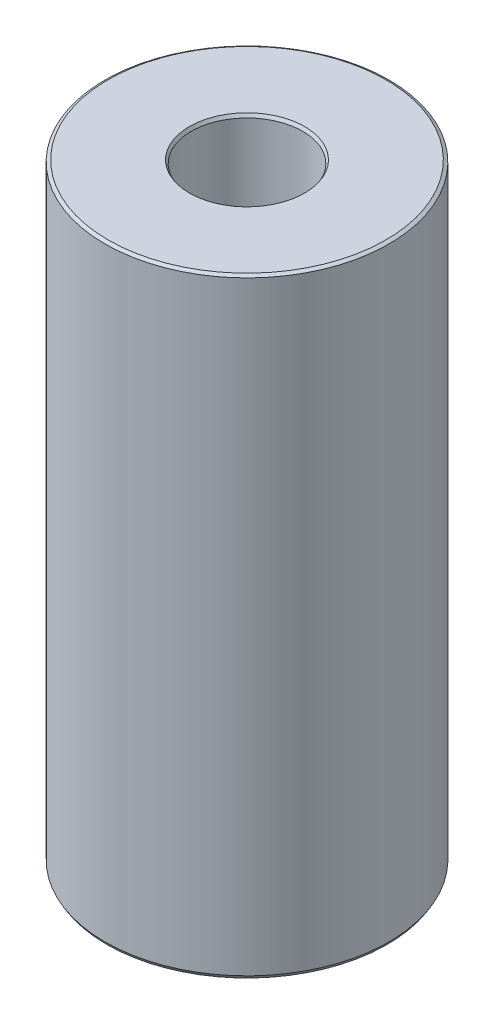
ISO-10303-21;
HEADER;
FILE_DESCRIPTION(('STEP AP214'),'2;1');
FILE_NAME('part.step','',(''),(''),'','','');
FILE_SCHEMA(('AUTOMOTIVE_DESIGN { 1 0 10303 214 1 1 1 1 }'));
ENDSEC;
DATA;
#1=APPLICATION_CONTEXT('core data for automotive mechanical design processes');
#2=APPLICATION_PROTOCOL_DEFINITION('international standard','automotive_design',2000,#1);
#3=PRODUCT_CONTEXT('',#1,'mechanical');
#4=PRODUCT('Part','Part','',(#3));
#5=PRODUCT_RELATED_PRODUCT_CATEGORY('part','',(#4));
#6=PRODUCT_DEFINITION_FORMATION('','',#4);
#7=PRODUCT_DEFINITION_CONTEXT('part definition',#1,'design');
#8=PRODUCT_DEFINITION('design','',#6,#7);
#9=PRODUCT_DEFINITION_SHAPE('','',#8);
#10=(LENGTH_UNIT() NAMED_UNIT(*) SI_UNIT(.MILLI.,.METRE.));
#11=(NAMED_UNIT(*) PLANE_ANGLE_UNIT() SI_UNIT($,.RADIAN.));
#12=(NAMED_UNIT(*) SI_UNIT($,.STERADIAN.) SOLID_ANGLE_UNIT());
#13=UNCERTAINTY_MEASURE_WITH_UNIT(LENGTH_MEASURE(1.E-05),#10,'distance_accuracy_value','');
#14=(GEOMETRIC_REPRESENTATION_CONTEXT(3) GLOBAL_UNCERTAINTY_ASSIGNED_CONTEXT((#13)) GLOBAL_UNIT_ASSIGNED_CONTEXT((#10,
#11,#12)) REPRESENTATION_CONTEXT('',''));
#15=CARTESIAN_POINT('',(0.,0.,0.));
#16=DIRECTION('',(0.,0.,1.));
#17=DIRECTION('',(1.,0.,0.));
#18=AXIS2_PLACEMENT_3D('',#15,#16,#17);
#19=CARTESIAN_POINT('',(0.,96.5479154680571,0.));
#20=DIRECTION('',(0.,-1.,0.));
#21=DIRECTION('',(0.,0.,-1.));
#22=AXIS2_PLACEMENT_3D('',#19,#20,#21);
#23=CYLINDRICAL_SURFACE('',#22,22.5);
#24=CARTESIAN_POINT('',(0.,0.505855402612276,0.));
#25=DIRECTION('',(0.,1.,0.));
#26=DIRECTION('',(0.,0.,1.));
#27=AXIS2_PLACEMENT_3D('',#24,#25,#26);
#28=CIRCLE('',#27,22.5);
#29=CARTESIAN_POINT('',(0.,0.505855402612276,22.5));
#30=VERTEX_POINT('',#29);
#31=EDGE_CURVE('E10',#30,#30,#28,.T.);
#32=ORIENTED_EDGE('',*,*,#31,.T.);
#33=EDGE_LOOP('',(#32));
#34=FACE_BOUND('',#33,.T.);
#35=CARTESIAN_POINT('',(0.,96.2558597151879,0.));
#36=DIRECTION('',(0.,1.,0.));
#37=DIRECTION('',(0.,0.,1.));
#38=AXIS2_PLACEMENT_3D('',#35,#36,#37);
#39=CIRCLE('',#38,22.5);
#40=CARTESIAN_POINT('',(0.,96.2558597151879,22.5));
#41=VERTEX_POINT('',#40);
#42=EDGE_CURVE('E50',#41,#41,#39,.F.);
#43=ORIENTED_EDGE('',*,*,#42,.T.);
#44=EDGE_LOOP('',(#43));
#45=FACE_BOUND('',#44,.T.);
#46=ADVANCED_FACE('F39',(#34,#45),#23,.T.);
#47=CARTESIAN_POINT('',(0.,96.5479154680571,0.));
#48=DIRECTION('',(0.,1.,0.));
#49=DIRECTION('',(0.,0.,1.));
#50=AXIS2_PLACEMENT_3D('',#47,#48,#49);
#51=PLANE('',#50);
#52=CARTESIAN_POINT('',(0.,96.5479154680571,0.));
#53=DIRECTION('',(0.,1.,0.));
#54=DIRECTION('',(0.,0.,1.));
#55=AXIS2_PLACEMENT_3D('',#52,#53,#54);
#56=CIRCLE('',#55,9.12925311601974);
#57=CARTESIAN_POINT('',(0.,96.5479154680571,9.12925311601974));
#58=VERTEX_POINT('',#57);
#59=EDGE_CURVE('E58',#58,#58,#56,.F.);
#60=ORIENTED_EDGE('',*,*,#59,.T.);
#61=EDGE_LOOP('',(#60));
#62=FACE_BOUND('',#61,.T.);
#63=CARTESIAN_POINT('',(0.,96.5479154680571,0.));
#64=DIRECTION('',(0.,1.,0.));
#65=DIRECTION('',(0.,0.,1.));
#66=AXIS2_PLACEMENT_3D('',#63,#64,#65);
#67=CIRCLE('',#66,21.9941445973878);
#68=CARTESIAN_POINT('',(0.,96.5479154680571,21.9941445973878));
#69=VERTEX_POINT('',#68);
#70=EDGE_CURVE('E61',#69,#69,#67,.T.);
#71=ORIENTED_EDGE('',*,*,#70,.T.);
#72=EDGE_LOOP('',(#71));
#73=FACE_BOUND('',#72,.T.);
#74=ADVANCED_FACE('F88',(#62,#73),#51,.T.);
#75=CARTESIAN_POINT('',(0.,0.,0.));
#76=DIRECTION('',(0.,1.,0.));
#77=DIRECTION('',(0.,0.,1.));
#78=AXIS2_PLACEMENT_3D('',#75,#76,#77);
#79=PLANE('',#78);
#80=CARTESIAN_POINT('',(0.,0.,0.));
#81=DIRECTION('',(0.,1.,0.));
#82=DIRECTION('',(0.,0.,1.));
#83=AXIS2_PLACEMENT_3D('',#80,#81,#82);
#84=CIRCLE('',#83,9.34305276576278);
#85=CARTESIAN_POINT('',(0.,0.,9.34305276576278));
#86=VERTEX_POINT('',#85);
#87=EDGE_CURVE('E51',#86,#86,#84,.T.);
#88=ORIENTED_EDGE('',*,*,#87,.T.);
#89=EDGE_LOOP('',(#88));
#90=FACE_BOUND('',#89,.T.);
#91=CARTESIAN_POINT('',(0.,0.,0.));
#92=DIRECTION('',(0.,1.,0.));
#93=DIRECTION('',(0.,0.,1.));
#94=AXIS2_PLACEMENT_3D('',#91,#92,#93);
#95=CIRCLE('',#94,22.2079442471308);
#96=CARTESIAN_POINT('',(0.,0.,22.2079442471308));
#97=VERTEX_POINT('',#96);
#98=EDGE_CURVE('E54',#97,#97,#95,.F.);
#99=ORIENTED_EDGE('',*,*,#98,.T.);
#100=EDGE_LOOP('',(#99));
#101=FACE_BOUND('',#100,.T.);
#102=ADVANCED_FACE('F83',(#90,#101),#79,.F.);
#103=CARTESIAN_POINT('',(0.,96.5479154680571,0.));
#104=DIRECTION('',(0.,-1.,0.));
#105=DIRECTION('',(0.,0.,-1.));
#106=AXIS2_PLACEMENT_3D('',#103,#104,#105);
#107=CYLINDRICAL_SURFACE('',#106,8.83719736315051);
#108=CARTESIAN_POINT('',(0.,96.0420600654448,0.));
#109=DIRECTION('',(0.,1.,0.));
#110=DIRECTION('',(0.,0.,1.));
#111=AXIS2_PLACEMENT_3D('',#108,#109,#110);
#112=CIRCLE('',#111,8.83719736315051);
#113=CARTESIAN_POINT('',(0.,96.0420600654448,8.83719736315051));
#114=VERTEX_POINT('',#113);
#115=EDGE_CURVE('E67',#114,#114,#112,.T.);
#116=ORIENTED_EDGE('',*,*,#115,.T.);
#117=EDGE_LOOP('',(#116));
#118=FACE_BOUND('',#117,.T.);
#119=CARTESIAN_POINT('',(0.,0.292055752869211,0.));
#120=DIRECTION('',(0.,1.,0.));
#121=DIRECTION('',(0.,0.,1.));
#122=AXIS2_PLACEMENT_3D('',#119,#120,#121);
#123=CIRCLE('',#122,8.83719736315051);
#124=CARTESIAN_POINT('',(0.,0.292055752869211,8.83719736315051));
#125=VERTEX_POINT('',#124);
#126=EDGE_CURVE('E69',#125,#125,#123,.F.);
#127=ORIENTED_EDGE('',*,*,#126,.T.);
#128=EDGE_LOOP('',(#127));
#129=FACE_BOUND('',#128,.T.);
#130=ADVANCED_FACE('F71',(#118,#129),#107,.F.);
#131=CARTESIAN_POINT('',(0.,96.0420600654448,0.));
#132=DIRECTION('',(0.,1.,0.));
#133=DIRECTION('',(0.,0.,1.));
#134=AXIS2_PLACEMENT_3D('',#131,#132,#133);
#135=CONICAL_SURFACE('',#134,8.83719736315051,0.523598775598299);
#136=ORIENTED_EDGE('',*,*,#59,.F.);
#137=EDGE_LOOP('',(#136));
#138=FACE_BOUND('',#137,.T.);
#139=ORIENTED_EDGE('',*,*,#115,.F.);
#140=EDGE_LOOP('',(#139));
#141=FACE_BOUND('',#140,.T.);
#142=ADVANCED_FACE('F77',(#138,#141),#135,.F.);
#143=CARTESIAN_POINT('',(0.,0.,0.));
#144=DIRECTION('',(0.,-1.,0.));
#145=DIRECTION('',(0.,0.,-1.));
#146=AXIS2_PLACEMENT_3D('',#143,#144,#145);
#147=CONICAL_SURFACE('',#146,9.34305276576278,1.04719755119661);
#148=ORIENTED_EDGE('',*,*,#126,.F.);
#149=EDGE_LOOP('',(#148));
#150=FACE_BOUND('',#149,.T.);
#151=ORIENTED_EDGE('',*,*,#87,.F.);
#152=EDGE_LOOP('',(#151));
#153=FACE_BOUND('',#152,.T.);
#154=ADVANCED_FACE('F73',(#150,#153),#147,.F.);
#155=CARTESIAN_POINT('',(0.,0.505855402612276,0.));
#156=DIRECTION('',(0.,1.,0.));
#157=DIRECTION('',(0.,0.,1.));
#158=AXIS2_PLACEMENT_3D('',#155,#156,#157);
#159=CONICAL_SURFACE('',#158,22.5,0.523598775598305);
#160=ORIENTED_EDGE('',*,*,#98,.F.);
#161=EDGE_LOOP('',(#160));
#162=FACE_BOUND('',#161,.T.);
#163=ORIENTED_EDGE('',*,*,#31,.F.);
#164=EDGE_LOOP('',(#163));
#165=FACE_BOUND('',#164,.T.);
#166=ADVANCED_FACE('F76',(#162,#165),#159,.T.);
#167=CARTESIAN_POINT('',(0.,96.5479154680571,0.));
#168=DIRECTION('',(0.,-1.,0.));
#169=DIRECTION('',(0.,0.,-1.));
#170=AXIS2_PLACEMENT_3D('',#167,#168,#169);
#171=CONICAL_SURFACE('',#170,21.9941445973878,1.04719755119659);
#172=ORIENTED_EDGE('',*,*,#42,.F.);
#173=EDGE_LOOP('',(#172));
#174=FACE_BOUND('',#173,.T.);
#175=ORIENTED_EDGE('',*,*,#70,.F.);
#176=EDGE_LOOP('',(#175));
#177=FACE_BOUND('',#176,.T.);
#178=ADVANCED_FACE('F45',(#174,#177),#171,.T.);
#179=CLOSED_SHELL('',(#46,#74,#102,#130,#142,#154,#166,#178));
#180=MANIFOLD_SOLID_BREP('B2',#179);
#181=ADVANCED_BREP_SHAPE_REPRESENTATION('',(#18,#180),#14);
#182=SHAPE_DEFINITION_REPRESENTATION(#9,#181);
ENDSEC;
END-ISO-10303-21;
